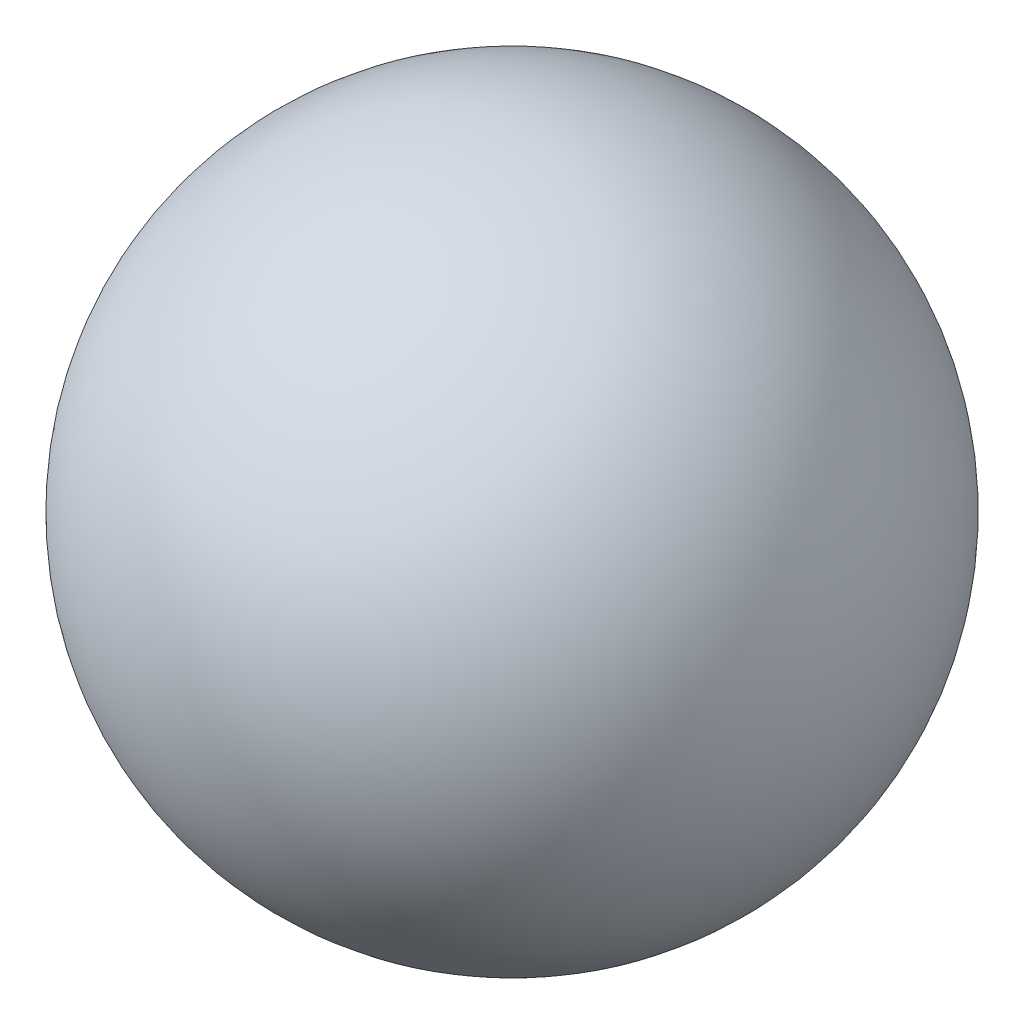
ISO-10303-21;
HEADER;
FILE_DESCRIPTION(('STEP AP214'),'2;1');
FILE_NAME('part.step','',(''),(''),'','','');
FILE_SCHEMA(('AUTOMOTIVE_DESIGN { 1 0 10303 214 1 1 1 1 }'));
ENDSEC;
DATA;
#1=APPLICATION_CONTEXT('core data for automotive mechanical design processes');
#2=APPLICATION_PROTOCOL_DEFINITION('international standard','automotive_design',2000,#1);
#3=PRODUCT_CONTEXT('',#1,'mechanical');
#4=PRODUCT('Part','Part','',(#3));
#5=PRODUCT_RELATED_PRODUCT_CATEGORY('part','',(#4));
#6=PRODUCT_DEFINITION_FORMATION('','',#4);
#7=PRODUCT_DEFINITION_CONTEXT('part definition',#1,'design');
#8=PRODUCT_DEFINITION('design','',#6,#7);
#9=PRODUCT_DEFINITION_SHAPE('','',#8);
#10=(LENGTH_UNIT() NAMED_UNIT(*) SI_UNIT(.MILLI.,.METRE.));
#11=(NAMED_UNIT(*) PLANE_ANGLE_UNIT() SI_UNIT($,.RADIAN.));
#12=(NAMED_UNIT(*) SI_UNIT($,.STERADIAN.) SOLID_ANGLE_UNIT());
#13=UNCERTAINTY_MEASURE_WITH_UNIT(LENGTH_MEASURE(1.E-05),#10,'distance_accuracy_value','');
#14=(GEOMETRIC_REPRESENTATION_CONTEXT(3) GLOBAL_UNCERTAINTY_ASSIGNED_CONTEXT((#13)) GLOBAL_UNIT_ASSIGNED_CONTEXT((#10,
#11,#12)) REPRESENTATION_CONTEXT('',''));
#15=CARTESIAN_POINT('',(0.,0.,0.));
#16=DIRECTION('',(0.,0.,1.));
#17=DIRECTION('',(1.,0.,0.));
#18=AXIS2_PLACEMENT_3D('',#15,#16,#17);
#19=CARTESIAN_POINT('',(1.5464799403088,1.67535326866786,0.));
#20=DIRECTION('',(0.,1.,0.));
#21=DIRECTION('',(-1.,0.,0.));
#22=AXIS2_PLACEMENT_3D('',#19,#20,#21);
#23=SPHERICAL_SURFACE('',#22,40.);
#24=CARTESIAN_POINT('',(1.5464799403088,41.6753532686679,0.));
#25=VERTEX_POINT('',#24);
#26=VERTEX_LOOP('',#25);
#27=FACE_BOUND('',#26,.T.);
#28=ADVANCED_FACE('F33',(#27),#23,.T.);
#29=CLOSED_SHELL('',(#28));
#30=MANIFOLD_SOLID_BREP('B2',#29);
#31=ADVANCED_BREP_SHAPE_REPRESENTATION('',(#18,#30),#14);
#32=SHAPE_DEFINITION_REPRESENTATION(#9,#31);
ENDSEC;
END-ISO-10303-21;
